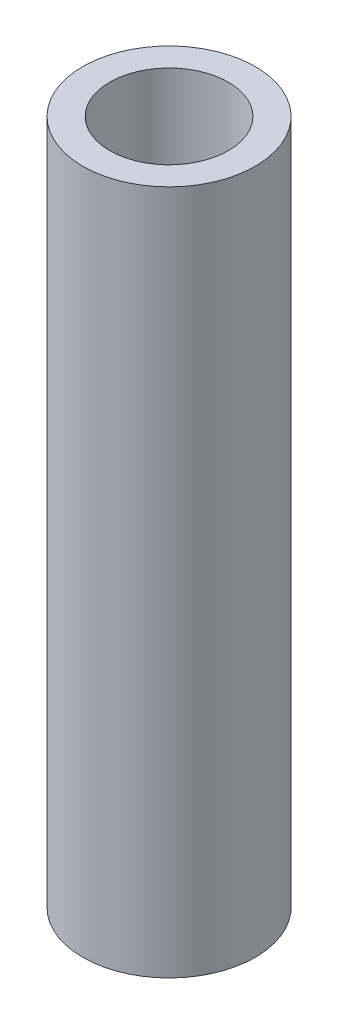
ISO-10303-21;
HEADER;
FILE_DESCRIPTION(('STEP AP214'),'2;1');
FILE_NAME('part.step','',(''),(''),'','','');
FILE_SCHEMA(('AUTOMOTIVE_DESIGN { 1 0 10303 214 1 1 1 1 }'));
ENDSEC;
DATA;
#1=APPLICATION_CONTEXT('core data for automotive mechanical design processes');
#2=APPLICATION_PROTOCOL_DEFINITION('international standard','automotive_design',2000,#1);
#3=PRODUCT_CONTEXT('',#1,'mechanical');
#4=PRODUCT('Part','Part','',(#3));
#5=PRODUCT_RELATED_PRODUCT_CATEGORY('part','',(#4));
#6=PRODUCT_DEFINITION_FORMATION('','',#4);
#7=PRODUCT_DEFINITION_CONTEXT('part definition',#1,'design');
#8=PRODUCT_DEFINITION('design','',#6,#7);
#9=PRODUCT_DEFINITION_SHAPE('','',#8);
#10=(LENGTH_UNIT() NAMED_UNIT(*) SI_UNIT(.MILLI.,.METRE.));
#11=(NAMED_UNIT(*) PLANE_ANGLE_UNIT() SI_UNIT($,.RADIAN.));
#12=(NAMED_UNIT(*) SI_UNIT($,.STERADIAN.) SOLID_ANGLE_UNIT());
#13=UNCERTAINTY_MEASURE_WITH_UNIT(LENGTH_MEASURE(1.E-05),#10,'distance_accuracy_value','');
#14=(GEOMETRIC_REPRESENTATION_CONTEXT(3) GLOBAL_UNCERTAINTY_ASSIGNED_CONTEXT((#13)) GLOBAL_UNIT_ASSIGNED_CONTEXT((#10,
#11,#12)) REPRESENTATION_CONTEXT('',''));
#15=CARTESIAN_POINT('',(0.,0.,0.));
#16=DIRECTION('',(0.,0.,1.));
#17=DIRECTION('',(1.,0.,0.));
#18=AXIS2_PLACEMENT_3D('',#15,#16,#17);
#19=CARTESIAN_POINT('',(0.,25.4,0.));
#20=DIRECTION('',(0.,1.,0.));
#21=DIRECTION('',(0.,0.,1.));
#22=AXIS2_PLACEMENT_3D('',#19,#20,#21);
#23=PLANE('',#22);
#24=CARTESIAN_POINT('',(0.,25.4,0.));
#25=DIRECTION('',(0.,1.,0.));
#26=DIRECTION('',(0.,0.,1.));
#27=AXIS2_PLACEMENT_3D('',#24,#25,#26);
#28=CIRCLE('',#27,3.2);
#29=CARTESIAN_POINT('',(0.,25.4,3.2));
#30=VERTEX_POINT('',#29);
#31=EDGE_CURVE('E10',#30,#30,#28,.T.);
#32=ORIENTED_EDGE('',*,*,#31,.T.);
#33=EDGE_LOOP('',(#32));
#34=FACE_BOUND('',#33,.T.);
#35=CARTESIAN_POINT('',(0.,25.4,0.));
#36=DIRECTION('',(0.,1.,0.));
#37=DIRECTION('',(0.,0.,1.));
#38=AXIS2_PLACEMENT_3D('',#35,#36,#37);
#39=CIRCLE('',#38,2.2);
#40=CARTESIAN_POINT('',(0.,25.4,2.2));
#41=VERTEX_POINT('',#40);
#42=EDGE_CURVE('E54',#41,#41,#39,.T.);
#43=ORIENTED_EDGE('',*,*,#42,.F.);
#44=EDGE_LOOP('',(#43));
#45=FACE_BOUND('',#44,.T.);
#46=ADVANCED_FACE('F41',(#34,#45),#23,.T.);
#47=CARTESIAN_POINT('',(0.,0.,0.));
#48=DIRECTION('',(0.,1.,0.));
#49=DIRECTION('',(0.,0.,1.));
#50=AXIS2_PLACEMENT_3D('',#47,#48,#49);
#51=PLANE('',#50);
#52=CARTESIAN_POINT('',(0.,0.,0.));
#53=DIRECTION('',(0.,1.,0.));
#54=DIRECTION('',(0.,0.,1.));
#55=AXIS2_PLACEMENT_3D('',#52,#53,#54);
#56=CIRCLE('',#55,3.2);
#57=CARTESIAN_POINT('',(0.,0.,3.2));
#58=VERTEX_POINT('',#57);
#59=EDGE_CURVE('E45',#58,#58,#56,.T.);
#60=ORIENTED_EDGE('',*,*,#59,.F.);
#61=EDGE_LOOP('',(#60));
#62=FACE_BOUND('',#61,.T.);
#63=CARTESIAN_POINT('',(0.,0.,0.));
#64=DIRECTION('',(0.,1.,0.));
#65=DIRECTION('',(0.,0.,1.));
#66=AXIS2_PLACEMENT_3D('',#63,#64,#65);
#67=CIRCLE('',#66,2.2);
#68=CARTESIAN_POINT('',(0.,0.,2.2));
#69=VERTEX_POINT('',#68);
#70=EDGE_CURVE('E56',#69,#69,#67,.T.);
#71=ORIENTED_EDGE('',*,*,#70,.T.);
#72=EDGE_LOOP('',(#71));
#73=FACE_BOUND('',#72,.T.);
#74=ADVANCED_FACE('F68',(#62,#73),#51,.F.);
#75=CARTESIAN_POINT('',(0.,25.4,0.));
#76=DIRECTION('',(0.,-1.,0.));
#77=DIRECTION('',(0.,0.,-1.));
#78=AXIS2_PLACEMENT_3D('',#75,#76,#77);
#79=CYLINDRICAL_SURFACE('',#78,3.2);
#80=ORIENTED_EDGE('',*,*,#31,.F.);
#81=EDGE_LOOP('',(#80));
#82=FACE_BOUND('',#81,.T.);
#83=ORIENTED_EDGE('',*,*,#59,.T.);
#84=EDGE_LOOP('',(#83));
#85=FACE_BOUND('',#84,.T.);
#86=ADVANCED_FACE('F43',(#82,#85),#79,.T.);
#87=CARTESIAN_POINT('',(0.,25.4,0.));
#88=DIRECTION('',(0.,-1.,0.));
#89=DIRECTION('',(0.,0.,-1.));
#90=AXIS2_PLACEMENT_3D('',#87,#88,#89);
#91=CYLINDRICAL_SURFACE('',#90,2.2);
#92=ORIENTED_EDGE('',*,*,#42,.T.);
#93=EDGE_LOOP('',(#92));
#94=FACE_BOUND('',#93,.T.);
#95=ORIENTED_EDGE('',*,*,#70,.F.);
#96=EDGE_LOOP('',(#95));
#97=FACE_BOUND('',#96,.T.);
#98=ADVANCED_FACE('F64',(#94,#97),#91,.F.);
#99=CLOSED_SHELL('',(#46,#74,#86,#98));
#100=MANIFOLD_SOLID_BREP('B2',#99);
#101=ADVANCED_BREP_SHAPE_REPRESENTATION('',(#18,#100),#14);
#102=SHAPE_DEFINITION_REPRESENTATION(#9,#101);
ENDSEC;
END-ISO-10303-21;
